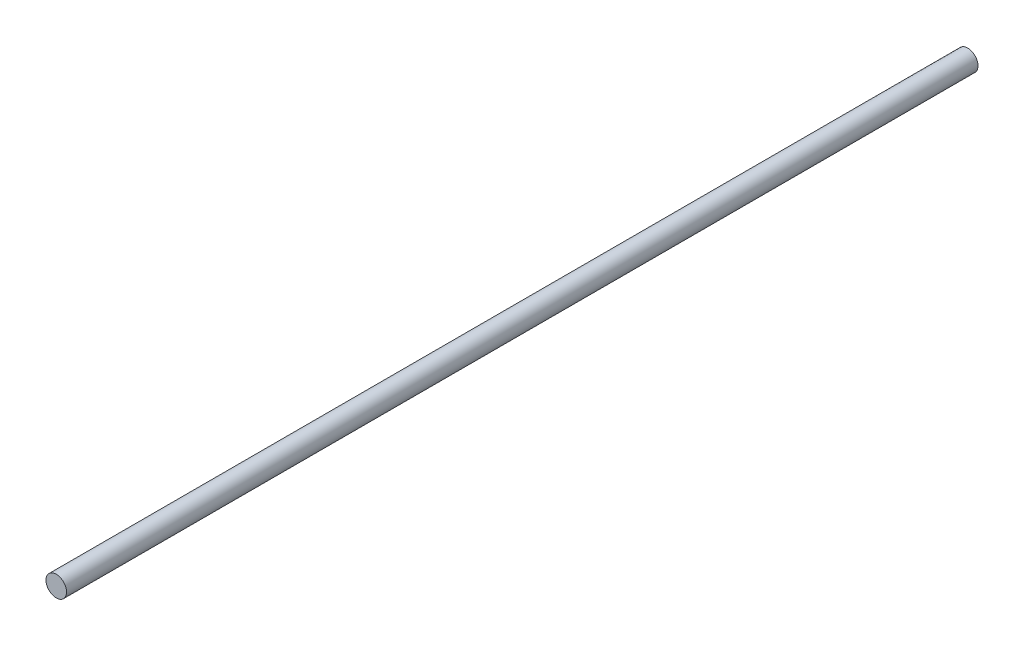
ISO-10303-21;
HEADER;
FILE_DESCRIPTION(('STEP AP214'),'2;1');
FILE_NAME('part.step','',(''),(''),'','','');
FILE_SCHEMA(('AUTOMOTIVE_DESIGN { 1 0 10303 214 1 1 1 1 }'));
ENDSEC;
DATA;
#1=APPLICATION_CONTEXT('core data for automotive mechanical design processes');
#2=APPLICATION_PROTOCOL_DEFINITION('international standard','automotive_design',2000,#1);
#3=PRODUCT_CONTEXT('',#1,'mechanical');
#4=PRODUCT('Part','Part','',(#3));
#5=PRODUCT_RELATED_PRODUCT_CATEGORY('part','',(#4));
#6=PRODUCT_DEFINITION_FORMATION('','',#4);
#7=PRODUCT_DEFINITION_CONTEXT('part definition',#1,'design');
#8=PRODUCT_DEFINITION('design','',#6,#7);
#9=PRODUCT_DEFINITION_SHAPE('','',#8);
#10=(LENGTH_UNIT() NAMED_UNIT(*) SI_UNIT(.MILLI.,.METRE.));
#11=(NAMED_UNIT(*) PLANE_ANGLE_UNIT() SI_UNIT($,.RADIAN.));
#12=(NAMED_UNIT(*) SI_UNIT($,.STERADIAN.) SOLID_ANGLE_UNIT());
#13=UNCERTAINTY_MEASURE_WITH_UNIT(LENGTH_MEASURE(1.E-05),#10,'distance_accuracy_value','');
#14=(GEOMETRIC_REPRESENTATION_CONTEXT(3) GLOBAL_UNCERTAINTY_ASSIGNED_CONTEXT((#13)) GLOBAL_UNIT_ASSIGNED_CONTEXT((#10,
#11,#12)) REPRESENTATION_CONTEXT('',''));
#15=CARTESIAN_POINT('',(0.,0.,0.));
#16=DIRECTION('',(0.,0.,1.));
#17=DIRECTION('',(1.,0.,0.));
#18=AXIS2_PLACEMENT_3D('',#15,#16,#17);
#19=CARTESIAN_POINT('',(0.,0.,532.));
#20=DIRECTION('',(0.,0.,-1.));
#21=DIRECTION('',(-1.,0.,0.));
#22=AXIS2_PLACEMENT_3D('',#19,#20,#21);
#23=CYLINDRICAL_SURFACE('',#22,6.);
#24=CARTESIAN_POINT('',(0.,0.,532.));
#25=DIRECTION('',(0.,0.,1.));
#26=DIRECTION('',(1.,0.,0.));
#27=AXIS2_PLACEMENT_3D('',#24,#25,#26);
#28=CIRCLE('',#27,6.);
#29=CARTESIAN_POINT('',(6.,0.,532.));
#30=VERTEX_POINT('',#29);
#31=EDGE_CURVE('E10',#30,#30,#28,.T.);
#32=ORIENTED_EDGE('',*,*,#31,.F.);
#33=EDGE_LOOP('',(#32));
#34=FACE_BOUND('',#33,.T.);
#35=CARTESIAN_POINT('',(0.,0.,0.));
#36=DIRECTION('',(0.,0.,1.));
#37=DIRECTION('',(1.,0.,0.));
#38=AXIS2_PLACEMENT_3D('',#35,#36,#37);
#39=CIRCLE('',#38,6.);
#40=CARTESIAN_POINT('',(6.,0.,0.));
#41=VERTEX_POINT('',#40);
#42=EDGE_CURVE('E34',#41,#41,#39,.T.);
#43=ORIENTED_EDGE('',*,*,#42,.T.);
#44=EDGE_LOOP('',(#43));
#45=FACE_BOUND('',#44,.T.);
#46=ADVANCED_FACE('F31',(#34,#45),#23,.T.);
#47=CARTESIAN_POINT('',(0.,0.,532.));
#48=DIRECTION('',(0.,0.,1.));
#49=DIRECTION('',(1.,0.,0.));
#50=AXIS2_PLACEMENT_3D('',#47,#48,#49);
#51=PLANE('',#50);
#52=ORIENTED_EDGE('',*,*,#31,.T.);
#53=EDGE_LOOP('',(#52));
#54=FACE_BOUND('',#53,.T.);
#55=ADVANCED_FACE('F46',(#54),#51,.T.);
#56=CARTESIAN_POINT('',(0.,0.,0.));
#57=DIRECTION('',(0.,0.,1.));
#58=DIRECTION('',(1.,0.,0.));
#59=AXIS2_PLACEMENT_3D('',#56,#57,#58);
#60=PLANE('',#59);
#61=ORIENTED_EDGE('',*,*,#42,.F.);
#62=EDGE_LOOP('',(#61));
#63=FACE_BOUND('',#62,.T.);
#64=ADVANCED_FACE('F44',(#63),#60,.F.);
#65=CLOSED_SHELL('',(#46,#55,#64));
#66=MANIFOLD_SOLID_BREP('B2',#65);
#67=ADVANCED_BREP_SHAPE_REPRESENTATION('',(#18,#66),#14);
#68=SHAPE_DEFINITION_REPRESENTATION(#9,#67);
ENDSEC;
END-ISO-10303-21;
